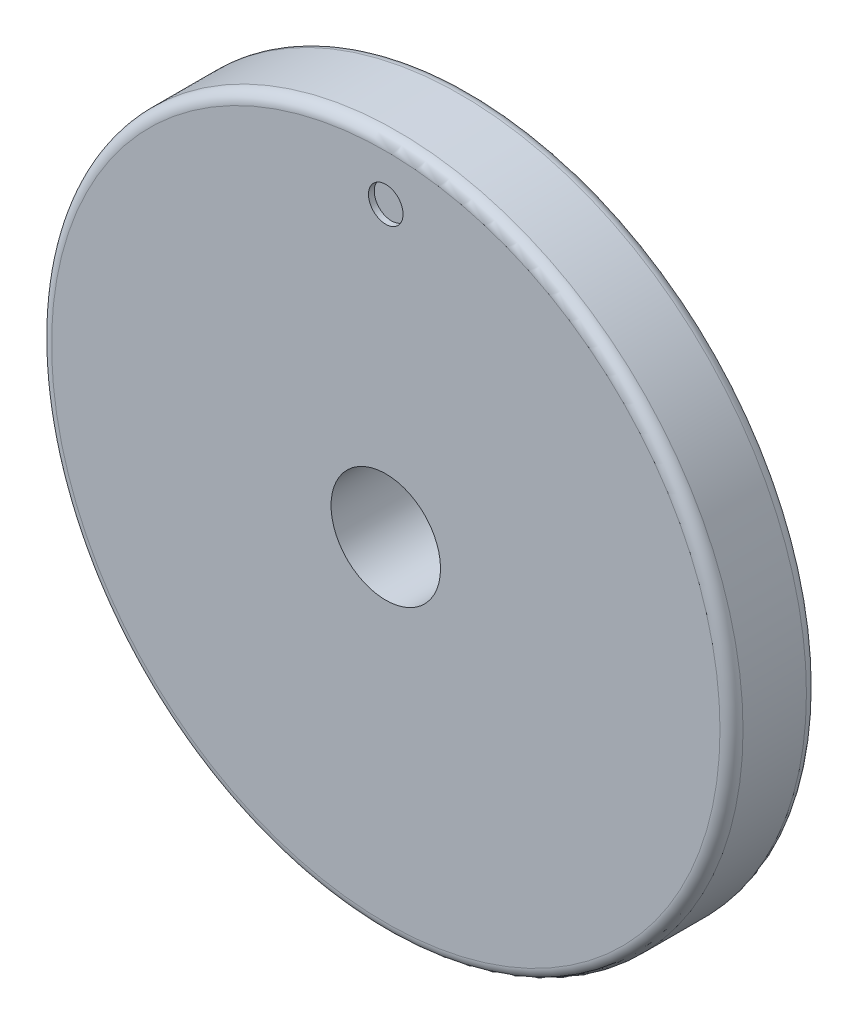
ISO-10303-21;
HEADER;
FILE_DESCRIPTION(('STEP AP214'),'2;1');
FILE_NAME('part.step','',(''),(''),'','','');
FILE_SCHEMA(('AUTOMOTIVE_DESIGN { 1 0 10303 214 1 1 1 1 }'));
ENDSEC;
DATA;
#1=APPLICATION_CONTEXT('core data for automotive mechanical design processes');
#2=APPLICATION_PROTOCOL_DEFINITION('international standard','automotive_design',2000,#1);
#3=PRODUCT_CONTEXT('',#1,'mechanical');
#4=PRODUCT('Part','Part','',(#3));
#5=PRODUCT_RELATED_PRODUCT_CATEGORY('part','',(#4));
#6=PRODUCT_DEFINITION_FORMATION('','',#4);
#7=PRODUCT_DEFINITION_CONTEXT('part definition',#1,'design');
#8=PRODUCT_DEFINITION('design','',#6,#7);
#9=PRODUCT_DEFINITION_SHAPE('','',#8);
#10=(LENGTH_UNIT() NAMED_UNIT(*) SI_UNIT(.MILLI.,.METRE.));
#11=(NAMED_UNIT(*) PLANE_ANGLE_UNIT() SI_UNIT($,.RADIAN.));
#12=(NAMED_UNIT(*) SI_UNIT($,.STERADIAN.) SOLID_ANGLE_UNIT());
#13=UNCERTAINTY_MEASURE_WITH_UNIT(LENGTH_MEASURE(1.E-05),#10,'distance_accuracy_value','');
#14=(GEOMETRIC_REPRESENTATION_CONTEXT(3) GLOBAL_UNCERTAINTY_ASSIGNED_CONTEXT((#13)) GLOBAL_UNIT_ASSIGNED_CONTEXT((#10,
#11,#12)) REPRESENTATION_CONTEXT('',''));
#15=CARTESIAN_POINT('',(0.,0.,0.));
#16=DIRECTION('',(0.,0.,1.));
#17=DIRECTION('',(1.,0.,0.));
#18=AXIS2_PLACEMENT_3D('',#15,#16,#17);
#19=CARTESIAN_POINT('',(0.,0.,7.5));
#20=DIRECTION('',(0.,0.,1.));
#21=DIRECTION('',(1.,0.,0.));
#22=AXIS2_PLACEMENT_3D('',#19,#20,#21);
#23=PLANE('',#22);
#24=CARTESIAN_POINT('',(0.,50.,7.5));
#25=DIRECTION('',(0.,0.,1.));
#26=DIRECTION('',(1.,0.,0.));
#27=AXIS2_PLACEMENT_3D('',#24,#25,#26);
#28=CIRCLE('',#27,3.);
#29=CARTESIAN_POINT('',(3.,50.,7.5));
#30=VERTEX_POINT('',#29);
#31=EDGE_CURVE('E41',#30,#30,#28,.T.);
#32=ORIENTED_EDGE('',*,*,#31,.F.);
#33=EDGE_LOOP('',(#32));
#34=FACE_BOUND('',#33,.T.);
#35=CARTESIAN_POINT('',(0.,0.,7.5));
#36=DIRECTION('',(0.,0.,1.));
#37=DIRECTION('',(1.,0.,0.));
#38=AXIS2_PLACEMENT_3D('',#35,#36,#37);
#39=CIRCLE('',#38,58.);
#40=CARTESIAN_POINT('',(58.,0.,7.5));
#41=VERTEX_POINT('',#40);
#42=EDGE_CURVE('E10',#41,#41,#39,.T.);
#43=ORIENTED_EDGE('',*,*,#42,.T.);
#44=EDGE_LOOP('',(#43));
#45=FACE_BOUND('',#44,.T.);
#46=CARTESIAN_POINT('',(0.,0.,7.5));
#47=DIRECTION('',(0.,0.,1.));
#48=DIRECTION('',(1.,0.,0.));
#49=AXIS2_PLACEMENT_3D('',#46,#47,#48);
#50=CIRCLE('',#49,9.5);
#51=CARTESIAN_POINT('',(9.5,0.,7.5));
#52=VERTEX_POINT('',#51);
#53=EDGE_CURVE('E34',#52,#52,#50,.T.);
#54=ORIENTED_EDGE('',*,*,#53,.F.);
#55=EDGE_LOOP('',(#54));
#56=FACE_BOUND('',#55,.T.);
#57=ADVANCED_FACE('F14',(#34,#45,#56),#23,.T.);
#58=CARTESIAN_POINT('',(0.,0.,-7.5));
#59=DIRECTION('',(0.,0.,1.));
#60=DIRECTION('',(1.,0.,0.));
#61=AXIS2_PLACEMENT_3D('',#58,#59,#60);
#62=PLANE('',#61);
#63=CARTESIAN_POINT('',(0.,50.,-7.5));
#64=DIRECTION('',(0.,0.,1.));
#65=DIRECTION('',(1.,0.,0.));
#66=AXIS2_PLACEMENT_3D('',#63,#64,#65);
#67=CIRCLE('',#66,3.);
#68=CARTESIAN_POINT('',(3.,50.,-7.5));
#69=VERTEX_POINT('',#68);
#70=EDGE_CURVE('E47',#69,#69,#67,.T.);
#71=ORIENTED_EDGE('',*,*,#70,.T.);
#72=EDGE_LOOP('',(#71));
#73=FACE_BOUND('',#72,.T.);
#74=CARTESIAN_POINT('',(0.,0.,-7.5));
#75=DIRECTION('',(0.,0.,1.));
#76=DIRECTION('',(1.,0.,0.));
#77=AXIS2_PLACEMENT_3D('',#74,#75,#76);
#78=CIRCLE('',#77,58.);
#79=CARTESIAN_POINT('',(58.,0.,-7.5));
#80=VERTEX_POINT('',#79);
#81=EDGE_CURVE('E21',#80,#80,#78,.F.);
#82=ORIENTED_EDGE('',*,*,#81,.T.);
#83=EDGE_LOOP('',(#82));
#84=FACE_BOUND('',#83,.T.);
#85=CARTESIAN_POINT('',(0.,0.,-7.5));
#86=DIRECTION('',(0.,0.,1.));
#87=DIRECTION('',(1.,0.,0.));
#88=AXIS2_PLACEMENT_3D('',#85,#86,#87);
#89=CIRCLE('',#88,9.5);
#90=CARTESIAN_POINT('',(9.5,0.,-7.5));
#91=VERTEX_POINT('',#90);
#92=EDGE_CURVE('E35',#91,#91,#89,.T.);
#93=ORIENTED_EDGE('',*,*,#92,.T.);
#94=EDGE_LOOP('',(#93));
#95=FACE_BOUND('',#94,.T.);
#96=ADVANCED_FACE('F67',(#73,#84,#95),#62,.F.);
#97=CARTESIAN_POINT('',(0.,0.,7.5));
#98=DIRECTION('',(0.,0.,-1.));
#99=DIRECTION('',(-1.,0.,0.));
#100=AXIS2_PLACEMENT_3D('',#97,#98,#99);
#101=CYLINDRICAL_SURFACE('',#100,60.);
#102=CARTESIAN_POINT('',(0.,0.,-5.5));
#103=DIRECTION('',(0.,0.,1.));
#104=DIRECTION('',(1.,0.,0.));
#105=AXIS2_PLACEMENT_3D('',#102,#103,#104);
#106=CIRCLE('',#105,60.);
#107=CARTESIAN_POINT('',(60.,0.,-5.5));
#108=VERTEX_POINT('',#107);
#109=EDGE_CURVE('E25',#108,#108,#106,.T.);
#110=ORIENTED_EDGE('',*,*,#109,.T.);
#111=EDGE_LOOP('',(#110));
#112=FACE_BOUND('',#111,.T.);
#113=CARTESIAN_POINT('',(0.,0.,5.5));
#114=DIRECTION('',(0.,0.,1.));
#115=DIRECTION('',(1.,0.,0.));
#116=AXIS2_PLACEMENT_3D('',#113,#114,#115);
#117=CIRCLE('',#116,60.);
#118=CARTESIAN_POINT('',(60.,0.,5.5));
#119=VERTEX_POINT('',#118);
#120=EDGE_CURVE('E29',#119,#119,#117,.F.);
#121=ORIENTED_EDGE('',*,*,#120,.T.);
#122=EDGE_LOOP('',(#121));
#123=FACE_BOUND('',#122,.T.);
#124=ADVANCED_FACE('F74',(#112,#123),#101,.T.);
#125=CARTESIAN_POINT('',(0.,0.,7.5));
#126=DIRECTION('',(0.,0.,-1.));
#127=DIRECTION('',(-1.,0.,0.));
#128=AXIS2_PLACEMENT_3D('',#125,#126,#127);
#129=CYLINDRICAL_SURFACE('',#128,9.5);
#130=ORIENTED_EDGE('',*,*,#53,.T.);
#131=EDGE_LOOP('',(#130));
#132=FACE_BOUND('',#131,.T.);
#133=ORIENTED_EDGE('',*,*,#92,.F.);
#134=EDGE_LOOP('',(#133));
#135=FACE_BOUND('',#134,.T.);
#136=ADVANCED_FACE('F79',(#132,#135),#129,.F.);
#137=CARTESIAN_POINT('',(0.,0.,-5.5));
#138=DIRECTION('',(0.,0.,1.));
#139=DIRECTION('',(1.,0.,0.));
#140=AXIS2_PLACEMENT_3D('',#137,#138,#139);
#141=TOROIDAL_SURFACE('',#140,58.,2.);
#142=ORIENTED_EDGE('',*,*,#81,.F.);
#143=EDGE_LOOP('',(#142));
#144=FACE_BOUND('',#143,.T.);
#145=ORIENTED_EDGE('',*,*,#109,.F.);
#146=EDGE_LOOP('',(#145));
#147=FACE_BOUND('',#146,.T.);
#148=ADVANCED_FACE('F84',(#144,#147),#141,.T.);
#149=CARTESIAN_POINT('',(0.,0.,5.5));
#150=DIRECTION('',(0.,0.,1.));
#151=DIRECTION('',(1.,0.,0.));
#152=AXIS2_PLACEMENT_3D('',#149,#150,#151);
#153=TOROIDAL_SURFACE('',#152,58.,2.);
#154=ORIENTED_EDGE('',*,*,#120,.F.);
#155=EDGE_LOOP('',(#154));
#156=FACE_BOUND('',#155,.T.);
#157=ORIENTED_EDGE('',*,*,#42,.F.);
#158=EDGE_LOOP('',(#157));
#159=FACE_BOUND('',#158,.T.);
#160=ADVANCED_FACE('F16',(#156,#159),#153,.T.);
#161=CARTESIAN_POINT('',(0.,50.,6.5));
#162=DIRECTION('',(0.,0.,1.));
#163=DIRECTION('',(1.,0.,0.));
#164=AXIS2_PLACEMENT_3D('',#161,#162,#163);
#165=CYLINDRICAL_SURFACE('',#164,3.);
#166=CARTESIAN_POINT('',(0.,50.,6.5));
#167=DIRECTION('',(0.,0.,1.));
#168=DIRECTION('',(1.,0.,0.));
#169=AXIS2_PLACEMENT_3D('',#166,#167,#168);
#170=CIRCLE('',#169,3.);
#171=CARTESIAN_POINT('',(3.,50.,6.5));
#172=VERTEX_POINT('',#171);
#173=EDGE_CURVE('E38',#172,#172,#170,.T.);
#174=ORIENTED_EDGE('',*,*,#173,.F.);
#175=EDGE_LOOP('',(#174));
#176=FACE_BOUND('',#175,.T.);
#177=ORIENTED_EDGE('',*,*,#31,.T.);
#178=EDGE_LOOP('',(#177));
#179=FACE_BOUND('',#178,.T.);
#180=ADVANCED_FACE('F92',(#176,#179),#165,.F.);
#181=CARTESIAN_POINT('',(0.,50.,6.5));
#182=DIRECTION('',(0.,0.,1.));
#183=DIRECTION('',(1.,0.,0.));
#184=AXIS2_PLACEMENT_3D('',#181,#182,#183);
#185=PLANE('',#184);
#186=ORIENTED_EDGE('',*,*,#173,.T.);
#187=EDGE_LOOP('',(#186));
#188=FACE_BOUND('',#187,.T.);
#189=ADVANCED_FACE('F64',(#188),#185,.T.);
#190=CARTESIAN_POINT('',(0.,50.,-6.5));
#191=DIRECTION('',(0.,0.,-1.));
#192=DIRECTION('',(-1.,0.,0.));
#193=AXIS2_PLACEMENT_3D('',#190,#191,#192);
#194=CYLINDRICAL_SURFACE('',#193,3.);
#195=CARTESIAN_POINT('',(0.,50.,-6.5));
#196=DIRECTION('',(0.,0.,1.));
#197=DIRECTION('',(1.,0.,0.));
#198=AXIS2_PLACEMENT_3D('',#195,#196,#197);
#199=CIRCLE('',#198,3.);
#200=CARTESIAN_POINT('',(3.,50.,-6.5));
#201=VERTEX_POINT('',#200);
#202=EDGE_CURVE('E44',#201,#201,#199,.T.);
#203=ORIENTED_EDGE('',*,*,#202,.T.);
#204=EDGE_LOOP('',(#203));
#205=FACE_BOUND('',#204,.T.);
#206=ORIENTED_EDGE('',*,*,#70,.F.);
#207=EDGE_LOOP('',(#206));
#208=FACE_BOUND('',#207,.T.);
#209=ADVANCED_FACE('F53',(#205,#208),#194,.F.);
#210=CARTESIAN_POINT('',(0.,50.,-6.5));
#211=DIRECTION('',(0.,0.,-1.));
#212=DIRECTION('',(1.,0.,0.));
#213=AXIS2_PLACEMENT_3D('',#210,#211,#212);
#214=PLANE('',#213);
#215=ORIENTED_EDGE('',*,*,#202,.F.);
#216=EDGE_LOOP('',(#215));
#217=FACE_BOUND('',#216,.T.);
#218=ADVANCED_FACE('F56',(#217),#214,.T.);
#219=CLOSED_SHELL('',(#57,#96,#124,#136,#148,#160,#180,#189,#209,#218));
#220=MANIFOLD_SOLID_BREP('B1',#219);
#221=ADVANCED_BREP_SHAPE_REPRESENTATION('',(#18,#220),#14);
#222=SHAPE_DEFINITION_REPRESENTATION(#9,#221);
ENDSEC;
END-ISO-10303-21;
